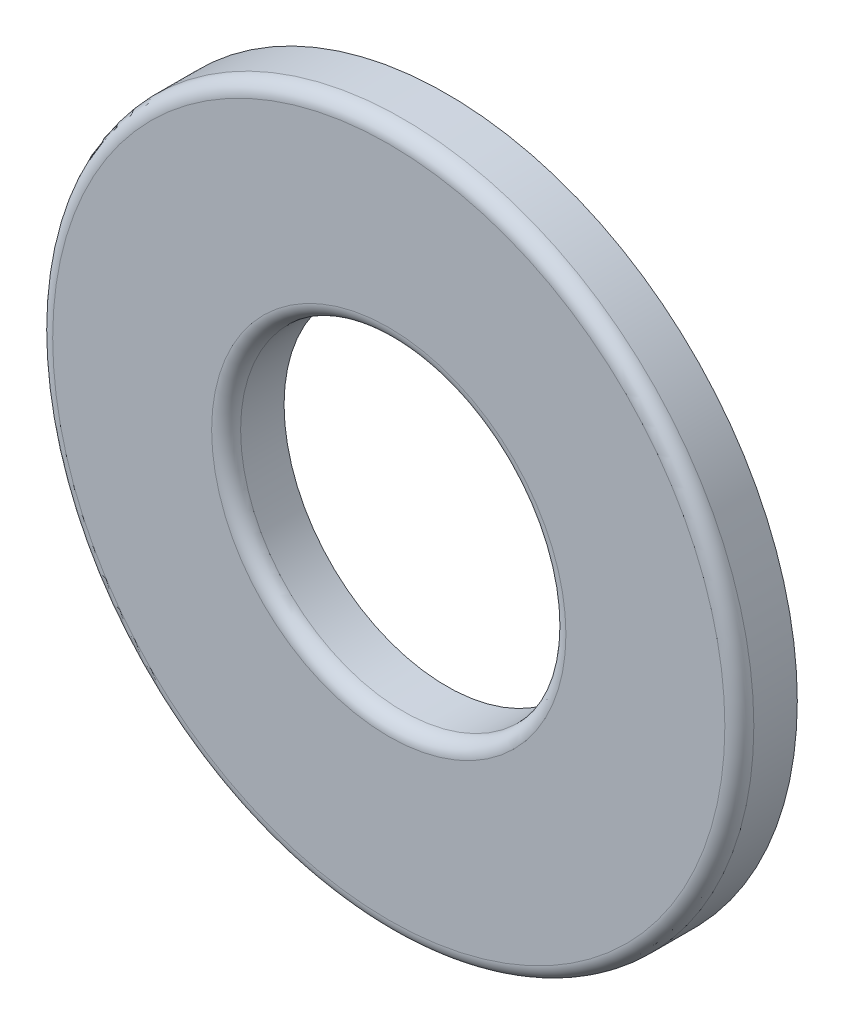
ISO-10303-21;
HEADER;
FILE_DESCRIPTION(('STEP AP214'),'2;1');
FILE_NAME('part.step','',(''),(''),'','','');
FILE_SCHEMA(('AUTOMOTIVE_DESIGN { 1 0 10303 214 1 1 1 1 }'));
ENDSEC;
DATA;
#1=APPLICATION_CONTEXT('core data for automotive mechanical design processes');
#2=APPLICATION_PROTOCOL_DEFINITION('international standard','automotive_design',2000,#1);
#3=PRODUCT_CONTEXT('',#1,'mechanical');
#4=PRODUCT('Part','Part','',(#3));
#5=PRODUCT_RELATED_PRODUCT_CATEGORY('part','',(#4));
#6=PRODUCT_DEFINITION_FORMATION('','',#4);
#7=PRODUCT_DEFINITION_CONTEXT('part definition',#1,'design');
#8=PRODUCT_DEFINITION('design','',#6,#7);
#9=PRODUCT_DEFINITION_SHAPE('','',#8);
#10=(LENGTH_UNIT() NAMED_UNIT(*) SI_UNIT(.MILLI.,.METRE.));
#11=(NAMED_UNIT(*) PLANE_ANGLE_UNIT() SI_UNIT($,.RADIAN.));
#12=(NAMED_UNIT(*) SI_UNIT($,.STERADIAN.) SOLID_ANGLE_UNIT());
#13=UNCERTAINTY_MEASURE_WITH_UNIT(LENGTH_MEASURE(1.E-05),#10,'distance_accuracy_value','');
#14=(GEOMETRIC_REPRESENTATION_CONTEXT(3) GLOBAL_UNCERTAINTY_ASSIGNED_CONTEXT((#13)) GLOBAL_UNIT_ASSIGNED_CONTEXT((#10,
#11,#12)) REPRESENTATION_CONTEXT('',''));
#15=CARTESIAN_POINT('',(0.,0.,0.));
#16=DIRECTION('',(0.,0.,1.));
#17=DIRECTION('',(1.,0.,0.));
#18=AXIS2_PLACEMENT_3D('',#15,#16,#17);
#19=CARTESIAN_POINT('',(0.,0.,0.393699999999996));
#20=DIRECTION('',(0.,0.,1.));
#21=DIRECTION('',(1.,0.,0.));
#22=AXIS2_PLACEMENT_3D('',#19,#20,#21);
#23=PLANE('',#22);
#24=CARTESIAN_POINT('',(0.,0.,0.393699999999996));
#25=DIRECTION('',(0.,0.,1.));
#26=DIRECTION('',(1.,0.,0.));
#27=AXIS2_PLACEMENT_3D('',#24,#25,#26);
#28=CIRCLE('',#27,4.56565);
#29=CARTESIAN_POINT('',(4.56565,0.,0.393699999999996));
#30=VERTEX_POINT('',#29);
#31=EDGE_CURVE('E44',#30,#30,#28,.T.);
#32=ORIENTED_EDGE('',*,*,#31,.T.);
#33=EDGE_LOOP('',(#32));
#34=FACE_BOUND('',#33,.T.);
#35=CARTESIAN_POINT('',(0.,0.,0.393699999999996));
#36=DIRECTION('',(0.,0.,1.));
#37=DIRECTION('',(1.,0.,0.));
#38=AXIS2_PLACEMENT_3D('',#35,#36,#37);
#39=CIRCLE('',#38,2.40665);
#40=CARTESIAN_POINT('',(2.40665,0.,0.393699999999996));
#41=VERTEX_POINT('',#40);
#42=EDGE_CURVE('E48',#41,#41,#39,.F.);
#43=ORIENTED_EDGE('',*,*,#42,.T.);
#44=EDGE_LOOP('',(#43));
#45=FACE_BOUND('',#44,.T.);
#46=ADVANCED_FACE('F33',(#34,#45),#23,.T.);
#47=CARTESIAN_POINT('',(0.,0.,0.393699999999996));
#48=DIRECTION('',(0.,0.,-1.));
#49=DIRECTION('',(-1.,0.,0.));
#50=AXIS2_PLACEMENT_3D('',#47,#48,#49);
#51=CYLINDRICAL_SURFACE('',#50,4.7625);
#52=CARTESIAN_POINT('',(0.,0.,0.196849999999996));
#53=DIRECTION('',(0.,0.,1.));
#54=DIRECTION('',(1.,0.,0.));
#55=AXIS2_PLACEMENT_3D('',#52,#53,#54);
#56=CIRCLE('',#55,4.7625);
#57=CARTESIAN_POINT('',(4.7625,0.,0.196849999999996));
#58=VERTEX_POINT('',#57);
#59=EDGE_CURVE('E40',#58,#58,#56,.F.);
#60=ORIENTED_EDGE('',*,*,#59,.T.);
#61=EDGE_LOOP('',(#60));
#62=FACE_BOUND('',#61,.T.);
#63=CARTESIAN_POINT('',(0.,0.,-0.393700000000004));
#64=DIRECTION('',(0.,0.,1.));
#65=DIRECTION('',(1.,0.,0.));
#66=AXIS2_PLACEMENT_3D('',#63,#64,#65);
#67=CIRCLE('',#66,4.7625);
#68=CARTESIAN_POINT('',(4.7625,0.,-0.393700000000004));
#69=VERTEX_POINT('',#68);
#70=EDGE_CURVE('E53',#69,#69,#67,.T.);
#71=ORIENTED_EDGE('',*,*,#70,.T.);
#72=EDGE_LOOP('',(#71));
#73=FACE_BOUND('',#72,.T.);
#74=ADVANCED_FACE('F65',(#62,#73),#51,.T.);
#75=CARTESIAN_POINT('',(0.,0.,0.393699999999996));
#76=DIRECTION('',(0.,0.,-1.));
#77=DIRECTION('',(-1.,0.,0.));
#78=AXIS2_PLACEMENT_3D('',#75,#76,#77);
#79=CYLINDRICAL_SURFACE('',#78,2.2098);
#80=CARTESIAN_POINT('',(0.,0.,0.196849999999996));
#81=DIRECTION('',(0.,0.,1.));
#82=DIRECTION('',(1.,0.,0.));
#83=AXIS2_PLACEMENT_3D('',#80,#81,#82);
#84=CIRCLE('',#83,2.2098);
#85=CARTESIAN_POINT('',(2.2098,0.,0.196849999999996));
#86=VERTEX_POINT('',#85);
#87=EDGE_CURVE('E10',#86,#86,#84,.T.);
#88=ORIENTED_EDGE('',*,*,#87,.T.);
#89=EDGE_LOOP('',(#88));
#90=FACE_BOUND('',#89,.T.);
#91=CARTESIAN_POINT('',(0.,0.,-0.393700000000004));
#92=DIRECTION('',(0.,0.,1.));
#93=DIRECTION('',(1.,0.,0.));
#94=AXIS2_PLACEMENT_3D('',#91,#92,#93);
#95=CIRCLE('',#94,2.2098);
#96=CARTESIAN_POINT('',(2.2098,0.,-0.393700000000004));
#97=VERTEX_POINT('',#96);
#98=EDGE_CURVE('E56',#97,#97,#95,.T.);
#99=ORIENTED_EDGE('',*,*,#98,.F.);
#100=EDGE_LOOP('',(#99));
#101=FACE_BOUND('',#100,.T.);
#102=ADVANCED_FACE('F63',(#90,#101),#79,.F.);
#103=CARTESIAN_POINT('',(0.,0.,-0.393700000000004));
#104=DIRECTION('',(0.,0.,1.));
#105=DIRECTION('',(1.,0.,0.));
#106=AXIS2_PLACEMENT_3D('',#103,#104,#105);
#107=PLANE('',#106);
#108=ORIENTED_EDGE('',*,*,#98,.T.);
#109=EDGE_LOOP('',(#108));
#110=FACE_BOUND('',#109,.T.);
#111=ORIENTED_EDGE('',*,*,#70,.F.);
#112=EDGE_LOOP('',(#111));
#113=FACE_BOUND('',#112,.T.);
#114=ADVANCED_FACE('F60',(#110,#113),#107,.F.);
#115=CARTESIAN_POINT('',(0.,0.,0.196849999999996));
#116=DIRECTION('',(0.,0.,1.));
#117=DIRECTION('',(1.,0.,0.));
#118=AXIS2_PLACEMENT_3D('',#115,#116,#117);
#119=TOROIDAL_SURFACE('',#118,4.56565,0.19685);
#120=ORIENTED_EDGE('',*,*,#59,.F.);
#121=EDGE_LOOP('',(#120));
#122=FACE_BOUND('',#121,.T.);
#123=ORIENTED_EDGE('',*,*,#31,.F.);
#124=EDGE_LOOP('',(#123));
#125=FACE_BOUND('',#124,.T.);
#126=ADVANCED_FACE('F71',(#122,#125),#119,.T.);
#127=CARTESIAN_POINT('',(0.,0.,0.196849999999996));
#128=DIRECTION('',(0.,0.,1.));
#129=DIRECTION('',(1.,0.,0.));
#130=AXIS2_PLACEMENT_3D('',#127,#128,#129);
#131=TOROIDAL_SURFACE('',#130,2.40665,0.19685);
#132=ORIENTED_EDGE('',*,*,#42,.F.);
#133=EDGE_LOOP('',(#132));
#134=FACE_BOUND('',#133,.T.);
#135=ORIENTED_EDGE('',*,*,#87,.F.);
#136=EDGE_LOOP('',(#135));
#137=FACE_BOUND('',#136,.T.);
#138=ADVANCED_FACE('F35',(#134,#137),#131,.T.);
#139=CLOSED_SHELL('',(#46,#74,#102,#114,#126,#138));
#140=MANIFOLD_SOLID_BREP('B2',#139);
#141=ADVANCED_BREP_SHAPE_REPRESENTATION('',(#18,#140),#14);
#142=SHAPE_DEFINITION_REPRESENTATION(#9,#141);
ENDSEC;
END-ISO-10303-21;
